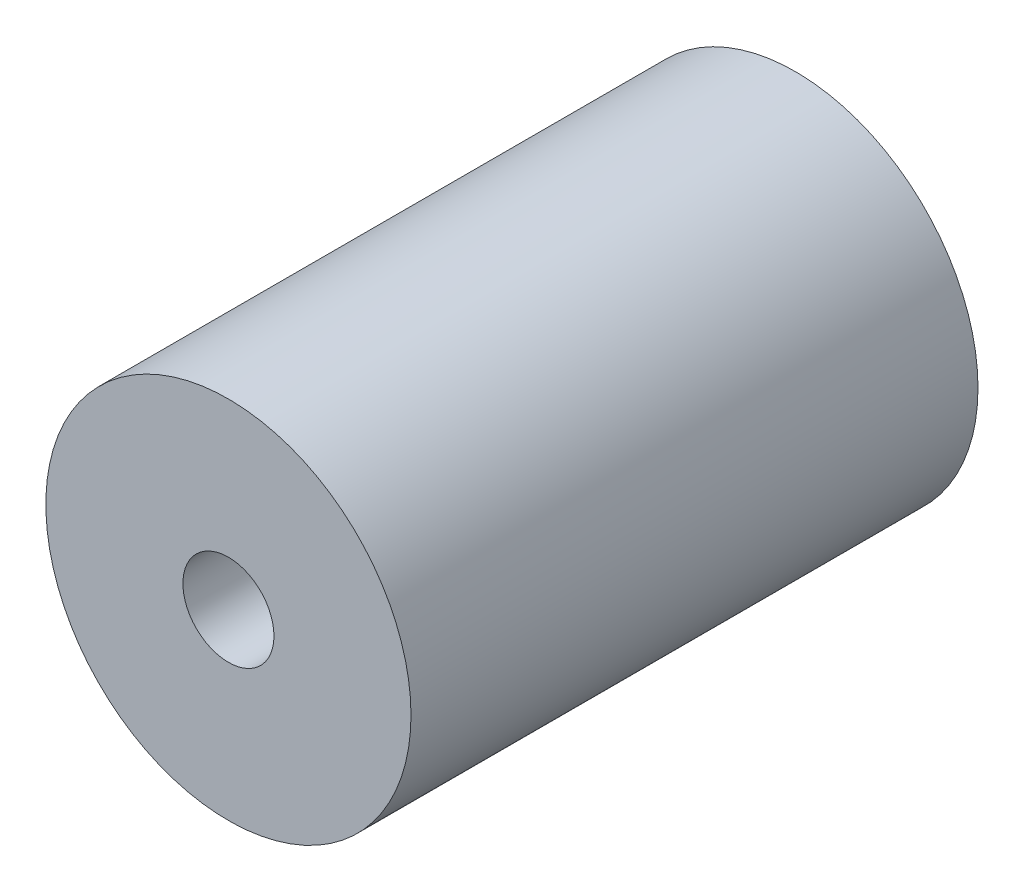
ISO-10303-21;
HEADER;
FILE_DESCRIPTION(('STEP AP214'),'2;1');
FILE_NAME('part.step','',(''),(''),'','','');
FILE_SCHEMA(('AUTOMOTIVE_DESIGN { 1 0 10303 214 1 1 1 1 }'));
ENDSEC;
DATA;
#1=APPLICATION_CONTEXT('core data for automotive mechanical design processes');
#2=APPLICATION_PROTOCOL_DEFINITION('international standard','automotive_design',2000,#1);
#3=PRODUCT_CONTEXT('',#1,'mechanical');
#4=PRODUCT('Part','Part','',(#3));
#5=PRODUCT_RELATED_PRODUCT_CATEGORY('part','',(#4));
#6=PRODUCT_DEFINITION_FORMATION('','',#4);
#7=PRODUCT_DEFINITION_CONTEXT('part definition',#1,'design');
#8=PRODUCT_DEFINITION('design','',#6,#7);
#9=PRODUCT_DEFINITION_SHAPE('','',#8);
#10=(LENGTH_UNIT() NAMED_UNIT(*) SI_UNIT(.MILLI.,.METRE.));
#11=(NAMED_UNIT(*) PLANE_ANGLE_UNIT() SI_UNIT($,.RADIAN.));
#12=(NAMED_UNIT(*) SI_UNIT($,.STERADIAN.) SOLID_ANGLE_UNIT());
#13=UNCERTAINTY_MEASURE_WITH_UNIT(LENGTH_MEASURE(1.E-05),#10,'distance_accuracy_value','');
#14=(GEOMETRIC_REPRESENTATION_CONTEXT(3) GLOBAL_UNCERTAINTY_ASSIGNED_CONTEXT((#13)) GLOBAL_UNIT_ASSIGNED_CONTEXT((#10,
#11,#12)) REPRESENTATION_CONTEXT('',''));
#15=CARTESIAN_POINT('',(0.,0.,0.));
#16=DIRECTION('',(0.,0.,1.));
#17=DIRECTION('',(1.,0.,0.));
#18=AXIS2_PLACEMENT_3D('',#15,#16,#17);
#19=CARTESIAN_POINT('',(0.,0.,19.05));
#20=DIRECTION('',(0.,0.,-1.));
#21=DIRECTION('',(-1.,0.,0.));
#22=AXIS2_PLACEMENT_3D('',#19,#20,#21);
#23=CYLINDRICAL_SURFACE('',#22,6.1341);
#24=CARTESIAN_POINT('',(0.,0.,19.05));
#25=DIRECTION('',(0.,0.,1.));
#26=DIRECTION('',(1.,0.,0.));
#27=AXIS2_PLACEMENT_3D('',#24,#25,#26);
#28=CIRCLE('',#27,6.1341);
#29=CARTESIAN_POINT('',(6.1341,0.,19.05));
#30=VERTEX_POINT('',#29);
#31=EDGE_CURVE('E10',#30,#30,#28,.T.);
#32=ORIENTED_EDGE('',*,*,#31,.F.);
#33=EDGE_LOOP('',(#32));
#34=FACE_BOUND('',#33,.T.);
#35=CARTESIAN_POINT('',(0.,0.,0.));
#36=DIRECTION('',(0.,0.,1.));
#37=DIRECTION('',(1.,0.,0.));
#38=AXIS2_PLACEMENT_3D('',#35,#36,#37);
#39=CIRCLE('',#38,6.1341);
#40=CARTESIAN_POINT('',(6.1341,0.,0.));
#41=VERTEX_POINT('',#40);
#42=EDGE_CURVE('E38',#41,#41,#39,.T.);
#43=ORIENTED_EDGE('',*,*,#42,.T.);
#44=EDGE_LOOP('',(#43));
#45=FACE_BOUND('',#44,.T.);
#46=ADVANCED_FACE('F31',(#34,#45),#23,.T.);
#47=CARTESIAN_POINT('',(0.,0.,19.05));
#48=DIRECTION('',(0.,0.,1.));
#49=DIRECTION('',(1.,0.,0.));
#50=AXIS2_PLACEMENT_3D('',#47,#48,#49);
#51=PLANE('',#50);
#52=CARTESIAN_POINT('',(0.,0.,19.05));
#53=DIRECTION('',(0.,0.,1.));
#54=DIRECTION('',(1.,0.,0.));
#55=AXIS2_PLACEMENT_3D('',#52,#53,#54);
#56=CIRCLE('',#55,1.53);
#57=CARTESIAN_POINT('',(1.53,0.,19.05));
#58=VERTEX_POINT('',#57);
#59=EDGE_CURVE('E43',#58,#58,#56,.T.);
#60=ORIENTED_EDGE('',*,*,#59,.F.);
#61=EDGE_LOOP('',(#60));
#62=FACE_BOUND('',#61,.T.);
#63=ORIENTED_EDGE('',*,*,#31,.T.);
#64=EDGE_LOOP('',(#63));
#65=FACE_BOUND('',#64,.T.);
#66=ADVANCED_FACE('F60',(#62,#65),#51,.T.);
#67=CARTESIAN_POINT('',(0.,0.,0.));
#68=DIRECTION('',(0.,0.,1.));
#69=DIRECTION('',(1.,0.,0.));
#70=AXIS2_PLACEMENT_3D('',#67,#68,#69);
#71=PLANE('',#70);
#72=CARTESIAN_POINT('',(0.,0.,0.));
#73=DIRECTION('',(0.,0.,-1.));
#74=DIRECTION('',(-1.,0.,0.));
#75=AXIS2_PLACEMENT_3D('',#72,#73,#74);
#76=CIRCLE('',#75,2.55269999999999);
#77=CARTESIAN_POINT('',(-2.55269999999999,0.,0.));
#78=VERTEX_POINT('',#77);
#79=EDGE_CURVE('E50',#78,#78,#76,.T.);
#80=ORIENTED_EDGE('',*,*,#79,.F.);
#81=EDGE_LOOP('',(#80));
#82=FACE_BOUND('',#81,.T.);
#83=ORIENTED_EDGE('',*,*,#42,.F.);
#84=EDGE_LOOP('',(#83));
#85=FACE_BOUND('',#84,.T.);
#86=ADVANCED_FACE('F56',(#82,#85),#71,.F.);
#87=CARTESIAN_POINT('',(0.,0.,0.));
#88=DIRECTION('',(0.,0.,1.));
#89=DIRECTION('',(1.,0.,0.));
#90=AXIS2_PLACEMENT_3D('',#87,#88,#89);
#91=CYLINDRICAL_SURFACE('',#90,1.53);
#92=CARTESIAN_POINT('',(0.,0.,10.1395001550795));
#93=DIRECTION('',(0.,0.,-1.));
#94=DIRECTION('',(-1.,0.,0.));
#95=AXIS2_PLACEMENT_3D('',#92,#93,#94);
#96=CIRCLE('',#95,1.53);
#97=CARTESIAN_POINT('',(-1.53,0.,10.1395001550795));
#98=VERTEX_POINT('',#97);
#99=EDGE_CURVE('E34',#98,#98,#96,.T.);
#100=ORIENTED_EDGE('',*,*,#99,.T.);
#101=EDGE_LOOP('',(#100));
#102=FACE_BOUND('',#101,.T.);
#103=ORIENTED_EDGE('',*,*,#59,.T.);
#104=EDGE_LOOP('',(#103));
#105=FACE_BOUND('',#104,.T.);
#106=ADVANCED_FACE('F59',(#102,#105),#91,.F.);
#107=CARTESIAN_POINT('',(0.,0.,9.525));
#108=DIRECTION('',(0.,0.,-1.));
#109=DIRECTION('',(-1.,0.,0.));
#110=AXIS2_PLACEMENT_3D('',#107,#108,#109);
#111=CONICAL_SURFACE('',#110,2.5527,1.02974425867665);
#112=CARTESIAN_POINT('',(0.,0.,9.525));
#113=DIRECTION('',(0.,0.,-1.));
#114=DIRECTION('',(-1.,0.,0.));
#115=AXIS2_PLACEMENT_3D('',#112,#113,#114);
#116=CIRCLE('',#115,2.5527);
#117=CARTESIAN_POINT('',(-2.5527,0.,9.525));
#118=VERTEX_POINT('',#117);
#119=EDGE_CURVE('E47',#118,#118,#116,.T.);
#120=ORIENTED_EDGE('',*,*,#119,.T.);
#121=EDGE_LOOP('',(#120));
#122=FACE_BOUND('',#121,.T.);
#123=ORIENTED_EDGE('',*,*,#99,.F.);
#124=EDGE_LOOP('',(#123));
#125=FACE_BOUND('',#124,.T.);
#126=ADVANCED_FACE('F76',(#122,#125),#111,.F.);
#127=CARTESIAN_POINT('',(0.,0.,0.));
#128=DIRECTION('',(0.,0.,-1.));
#129=DIRECTION('',(-1.,0.,0.));
#130=AXIS2_PLACEMENT_3D('',#127,#128,#129);
#131=CYLINDRICAL_SURFACE('',#130,2.55269999999999);
#132=ORIENTED_EDGE('',*,*,#119,.F.);
#133=EDGE_LOOP('',(#132));
#134=FACE_BOUND('',#133,.T.);
#135=ORIENTED_EDGE('',*,*,#79,.T.);
#136=EDGE_LOOP('',(#135));
#137=FACE_BOUND('',#136,.T.);
#138=ADVANCED_FACE('F54',(#134,#137),#131,.F.);
#139=CLOSED_SHELL('',(#46,#66,#86,#106,#126,#138));
#140=MANIFOLD_SOLID_BREP('B2',#139);
#141=ADVANCED_BREP_SHAPE_REPRESENTATION('',(#18,#140),#14);
#142=SHAPE_DEFINITION_REPRESENTATION(#9,#141);
ENDSEC;
END-ISO-10303-21;
